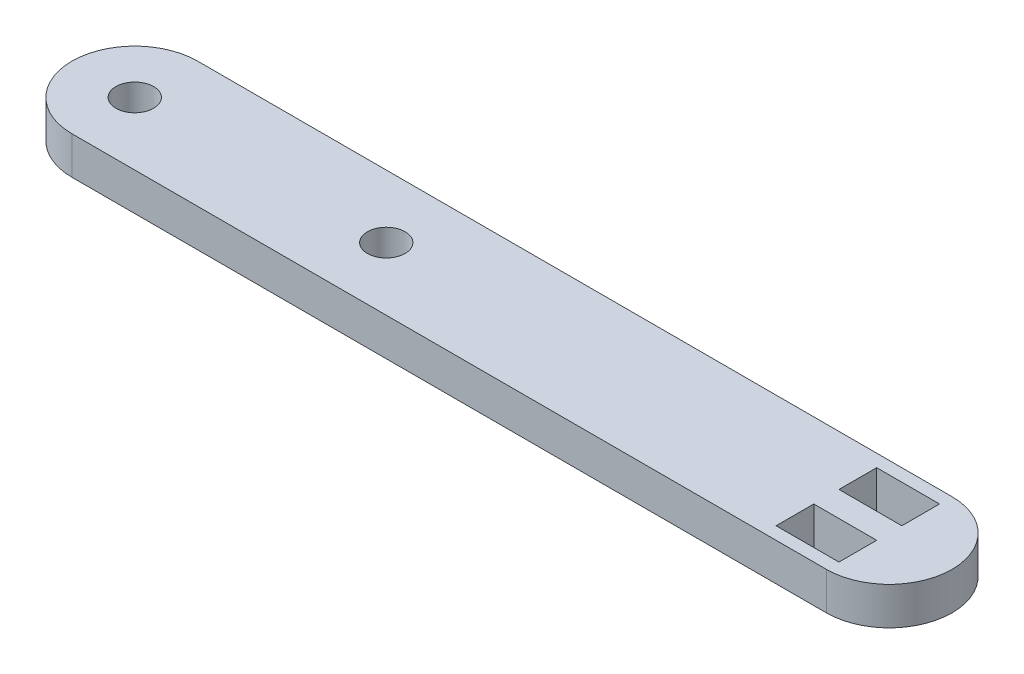
ISO-10303-21;
HEADER;
FILE_DESCRIPTION(('STEP AP214'),'2;1');
FILE_NAME('part.step','',(''),(''),'','','');
FILE_SCHEMA(('AUTOMOTIVE_DESIGN { 1 0 10303 214 1 1 1 1 }'));
ENDSEC;
DATA;
#1=APPLICATION_CONTEXT('core data for automotive mechanical design processes');
#2=APPLICATION_PROTOCOL_DEFINITION('international standard','automotive_design',2000,#1);
#3=PRODUCT_CONTEXT('',#1,'mechanical');
#4=PRODUCT('Part','Part','',(#3));
#5=PRODUCT_RELATED_PRODUCT_CATEGORY('part','',(#4));
#6=PRODUCT_DEFINITION_FORMATION('','',#4);
#7=PRODUCT_DEFINITION_CONTEXT('part definition',#1,'design');
#8=PRODUCT_DEFINITION('design','',#6,#7);
#9=PRODUCT_DEFINITION_SHAPE('','',#8);
#10=(LENGTH_UNIT() NAMED_UNIT(*) SI_UNIT(.MILLI.,.METRE.));
#11=(NAMED_UNIT(*) PLANE_ANGLE_UNIT() SI_UNIT($,.RADIAN.));
#12=(NAMED_UNIT(*) SI_UNIT($,.STERADIAN.) SOLID_ANGLE_UNIT());
#13=UNCERTAINTY_MEASURE_WITH_UNIT(LENGTH_MEASURE(1.E-05),#10,'distance_accuracy_value','');
#14=(GEOMETRIC_REPRESENTATION_CONTEXT(3) GLOBAL_UNCERTAINTY_ASSIGNED_CONTEXT((#13)) GLOBAL_UNIT_ASSIGNED_CONTEXT((#10,
#11,#12)) REPRESENTATION_CONTEXT('',''));
#15=CARTESIAN_POINT('',(0.,0.,0.));
#16=DIRECTION('',(0.,0.,1.));
#17=DIRECTION('',(1.,0.,0.));
#18=AXIS2_PLACEMENT_3D('',#15,#16,#17);
#19=CARTESIAN_POINT('',(0.,3.,-4.99999999999999));
#20=DIRECTION('',(0.,-1.,0.));
#21=DIRECTION('',(0.,0.,-1.));
#22=AXIS2_PLACEMENT_3D('',#19,#20,#21);
#23=PLANE('',#22);
#24=CARTESIAN_POINT('',(-40.,3.,-4.99999999999999));
#25=DIRECTION('',(0.,1.,0.));
#26=DIRECTION('',(0.,0.,1.));
#27=AXIS2_PLACEMENT_3D('',#24,#25,#26);
#28=CIRCLE('',#27,1.5);
#29=CARTESIAN_POINT('',(-40.,3.,-3.49999999999999));
#30=VERTEX_POINT('',#29);
#31=EDGE_CURVE('E159',#30,#30,#28,.T.);
#32=ORIENTED_EDGE('',*,*,#31,.F.);
#33=EDGE_LOOP('',(#32));
#34=FACE_BOUND('',#33,.T.);
#35=DIRECTION('',(0.,0.,-1.));
#36=VECTOR('',#35,1.);
#37=CARTESIAN_POINT('',(0.,3.,-6.));
#38=LINE('',#37,#36);
#39=CARTESIAN_POINT('',(0.,3.,-6.));
#40=VERTEX_POINT('',#39);
#41=CARTESIAN_POINT('',(0.,3.,-9.));
#42=VERTEX_POINT('',#41);
#43=EDGE_CURVE('E165',#40,#42,#38,.T.);
#44=ORIENTED_EDGE('',*,*,#43,.F.);
#45=DIRECTION('',(1.,0.,0.));
#46=VECTOR('',#45,1.);
#47=CARTESIAN_POINT('',(0.,3.,-6.));
#48=LINE('',#47,#46);
#49=CARTESIAN_POINT('',(-5.,3.,-6.));
#50=VERTEX_POINT('',#49);
#51=EDGE_CURVE('E173',#50,#40,#48,.T.);
#52=ORIENTED_EDGE('',*,*,#51,.F.);
#53=DIRECTION('',(0.,0.,1.));
#54=VECTOR('',#53,1.);
#55=CARTESIAN_POINT('',(-5.,3.,-6.));
#56=LINE('',#55,#54);
#57=CARTESIAN_POINT('',(-5.,3.,-9.));
#58=VERTEX_POINT('',#57);
#59=EDGE_CURVE('E170',#58,#50,#56,.T.);
#60=ORIENTED_EDGE('',*,*,#59,.F.);
#61=DIRECTION('',(-1.,0.,0.));
#62=VECTOR('',#61,1.);
#63=CARTESIAN_POINT('',(0.,3.,-9.));
#64=LINE('',#63,#62);
#65=EDGE_CURVE('E167',#42,#58,#64,.T.);
#66=ORIENTED_EDGE('',*,*,#65,.F.);
#67=EDGE_LOOP('',(#44,#52,#60,#66));
#68=FACE_BOUND('',#67,.T.);
#69=CARTESIAN_POINT('',(0.,3.,-4.99999999999999));
#70=DIRECTION('',(0.,1.,0.));
#71=DIRECTION('',(0.,0.,-1.));
#72=AXIS2_PLACEMENT_3D('',#69,#70,#71);
#73=CIRCLE('',#72,5.);
#74=CARTESIAN_POINT('',(0.,3.,0.));
#75=VERTEX_POINT('',#74);
#76=CARTESIAN_POINT('',(0.,3.,-10.));
#77=VERTEX_POINT('',#76);
#78=EDGE_CURVE('E202',#75,#77,#73,.T.);
#79=ORIENTED_EDGE('',*,*,#78,.T.);
#80=DIRECTION('',(-1.,0.,0.));
#81=VECTOR('',#80,1.);
#82=CARTESIAN_POINT('',(0.,3.,-10.));
#83=LINE('',#82,#81);
#84=CARTESIAN_POINT('',(-60.,3.,-9.99999999999999));
#85=VERTEX_POINT('',#84);
#86=EDGE_CURVE('E205',#77,#85,#83,.T.);
#87=ORIENTED_EDGE('',*,*,#86,.T.);
#88=CARTESIAN_POINT('',(-60.,3.,-4.99999999999999));
#89=DIRECTION('',(0.,1.,0.));
#90=DIRECTION('',(0.,0.,1.));
#91=AXIS2_PLACEMENT_3D('',#88,#89,#90);
#92=CIRCLE('',#91,5.);
#93=CARTESIAN_POINT('',(-60.,3.,0.));
#94=VERTEX_POINT('',#93);
#95=EDGE_CURVE('E208',#85,#94,#92,.T.);
#96=ORIENTED_EDGE('',*,*,#95,.T.);
#97=DIRECTION('',(1.,0.,0.));
#98=VECTOR('',#97,1.);
#99=CARTESIAN_POINT('',(0.,3.,0.));
#100=LINE('',#99,#98);
#101=EDGE_CURVE('E210',#94,#75,#100,.T.);
#102=ORIENTED_EDGE('',*,*,#101,.T.);
#103=EDGE_LOOP('',(#79,#87,#96,#102));
#104=FACE_BOUND('',#103,.T.);
#105=CARTESIAN_POINT('',(-60.,3.,-4.99999999999999));
#106=DIRECTION('',(0.,1.,0.));
#107=DIRECTION('',(0.,0.,1.));
#108=AXIS2_PLACEMENT_3D('',#105,#106,#107);
#109=CIRCLE('',#108,1.5);
#110=CARTESIAN_POINT('',(-60.,3.,-3.49999999999999));
#111=VERTEX_POINT('',#110);
#112=EDGE_CURVE('E196',#111,#111,#109,.T.);
#113=ORIENTED_EDGE('',*,*,#112,.F.);
#114=EDGE_LOOP('',(#113));
#115=FACE_BOUND('',#114,.T.);
#116=DIRECTION('',(0.,0.,-1.));
#117=VECTOR('',#116,1.);
#118=CARTESIAN_POINT('',(0.,3.,-3.99999999999999));
#119=LINE('',#118,#117);
#120=CARTESIAN_POINT('',(0.,3.,-0.99999999999999));
#121=VERTEX_POINT('',#120);
#122=CARTESIAN_POINT('',(0.,3.,-3.99999999999999));
#123=VERTEX_POINT('',#122);
#124=EDGE_CURVE('E123',#121,#123,#119,.T.);
#125=ORIENTED_EDGE('',*,*,#124,.F.);
#126=DIRECTION('',(1.,0.,0.));
#127=VECTOR('',#126,1.);
#128=CARTESIAN_POINT('',(0.,3.,-0.99999999999999));
#129=LINE('',#128,#127);
#130=CARTESIAN_POINT('',(-5.,3.,-0.99999999999999));
#131=VERTEX_POINT('',#130);
#132=EDGE_CURVE('E145',#131,#121,#129,.T.);
#133=ORIENTED_EDGE('',*,*,#132,.F.);
#134=DIRECTION('',(0.,0.,1.));
#135=VECTOR('',#134,1.);
#136=CARTESIAN_POINT('',(-5.,3.,-3.99999999999999));
#137=LINE('',#136,#135);
#138=CARTESIAN_POINT('',(-5.,3.,-3.99999999999999));
#139=VERTEX_POINT('',#138);
#140=EDGE_CURVE('E143',#139,#131,#137,.T.);
#141=ORIENTED_EDGE('',*,*,#140,.F.);
#142=DIRECTION('',(-1.,0.,0.));
#143=VECTOR('',#142,1.);
#144=CARTESIAN_POINT('',(0.,3.,-3.99999999999999));
#145=LINE('',#144,#143);
#146=EDGE_CURVE('E131',#123,#139,#145,.T.);
#147=ORIENTED_EDGE('',*,*,#146,.F.);
#148=EDGE_LOOP('',(#125,#133,#141,#147));
#149=FACE_BOUND('',#148,.T.);
#150=ADVANCED_FACE('F34',(#34,#68,#104,#115,#149),#23,.F.);
#151=CARTESIAN_POINT('',(0.,0.,-4.99999999999999));
#152=DIRECTION('',(0.,-1.,0.));
#153=DIRECTION('',(0.,0.,-1.));
#154=AXIS2_PLACEMENT_3D('',#151,#152,#153);
#155=PLANE('',#154);
#156=DIRECTION('',(1.,0.,0.));
#157=VECTOR('',#156,1.);
#158=CARTESIAN_POINT('',(0.,0.,-6.));
#159=LINE('',#158,#157);
#160=CARTESIAN_POINT('',(-5.,0.,-6.));
#161=VERTEX_POINT('',#160);
#162=CARTESIAN_POINT('',(0.,0.,-6.));
#163=VERTEX_POINT('',#162);
#164=EDGE_CURVE('E168',#161,#163,#159,.T.);
#165=ORIENTED_EDGE('',*,*,#164,.T.);
#166=DIRECTION('',(0.,0.,-1.));
#167=VECTOR('',#166,1.);
#168=CARTESIAN_POINT('',(0.,0.,-6.));
#169=LINE('',#168,#167);
#170=CARTESIAN_POINT('',(0.,0.,-9.));
#171=VERTEX_POINT('',#170);
#172=EDGE_CURVE('E162',#163,#171,#169,.T.);
#173=ORIENTED_EDGE('',*,*,#172,.T.);
#174=DIRECTION('',(-1.,0.,0.));
#175=VECTOR('',#174,1.);
#176=CARTESIAN_POINT('',(0.,0.,-9.));
#177=LINE('',#176,#175);
#178=CARTESIAN_POINT('',(-5.,0.,-9.));
#179=VERTEX_POINT('',#178);
#180=EDGE_CURVE('E178',#171,#179,#177,.T.);
#181=ORIENTED_EDGE('',*,*,#180,.T.);
#182=DIRECTION('',(0.,0.,1.));
#183=VECTOR('',#182,1.);
#184=CARTESIAN_POINT('',(-5.,0.,-6.));
#185=LINE('',#184,#183);
#186=EDGE_CURVE('E181',#179,#161,#185,.T.);
#187=ORIENTED_EDGE('',*,*,#186,.T.);
#188=EDGE_LOOP('',(#165,#173,#181,#187));
#189=FACE_BOUND('',#188,.T.);
#190=CARTESIAN_POINT('',(-60.,0.,-4.99999999999999));
#191=DIRECTION('',(0.,1.,0.));
#192=DIRECTION('',(0.,0.,1.));
#193=AXIS2_PLACEMENT_3D('',#190,#191,#192);
#194=CIRCLE('',#193,1.5);
#195=CARTESIAN_POINT('',(-60.,0.,-3.49999999999999));
#196=VERTEX_POINT('',#195);
#197=EDGE_CURVE('E195',#196,#196,#194,.T.);
#198=ORIENTED_EDGE('',*,*,#197,.T.);
#199=EDGE_LOOP('',(#198));
#200=FACE_BOUND('',#199,.T.);
#201=CARTESIAN_POINT('',(0.,0.,-4.99999999999999));
#202=DIRECTION('',(0.,1.,0.));
#203=DIRECTION('',(0.,0.,-1.));
#204=AXIS2_PLACEMENT_3D('',#201,#202,#203);
#205=CIRCLE('',#204,5.);
#206=CARTESIAN_POINT('',(0.,0.,0.));
#207=VERTEX_POINT('',#206);
#208=CARTESIAN_POINT('',(0.,0.,-10.));
#209=VERTEX_POINT('',#208);
#210=EDGE_CURVE('E199',#207,#209,#205,.T.);
#211=ORIENTED_EDGE('',*,*,#210,.F.);
#212=DIRECTION('',(1.,0.,0.));
#213=VECTOR('',#212,1.);
#214=CARTESIAN_POINT('',(0.,0.,0.));
#215=LINE('',#214,#213);
#216=CARTESIAN_POINT('',(-60.,0.,0.));
#217=VERTEX_POINT('',#216);
#218=EDGE_CURVE('E206',#217,#207,#215,.T.);
#219=ORIENTED_EDGE('',*,*,#218,.F.);
#220=CARTESIAN_POINT('',(-60.,0.,-4.99999999999999));
#221=DIRECTION('',(0.,1.,0.));
#222=DIRECTION('',(0.,0.,1.));
#223=AXIS2_PLACEMENT_3D('',#220,#221,#222);
#224=CIRCLE('',#223,5.);
#225=CARTESIAN_POINT('',(-60.,0.,-9.99999999999999));
#226=VERTEX_POINT('',#225);
#227=EDGE_CURVE('E217',#226,#217,#224,.T.);
#228=ORIENTED_EDGE('',*,*,#227,.F.);
#229=DIRECTION('',(-1.,0.,0.));
#230=VECTOR('',#229,1.);
#231=CARTESIAN_POINT('',(0.,0.,-10.));
#232=LINE('',#231,#230);
#233=EDGE_CURVE('E215',#209,#226,#232,.T.);
#234=ORIENTED_EDGE('',*,*,#233,.F.);
#235=EDGE_LOOP('',(#211,#219,#228,#234));
#236=FACE_BOUND('',#235,.T.);
#237=CARTESIAN_POINT('',(-40.,0.,-4.99999999999999));
#238=DIRECTION('',(0.,1.,0.));
#239=DIRECTION('',(0.,0.,1.));
#240=AXIS2_PLACEMENT_3D('',#237,#238,#239);
#241=CIRCLE('',#240,1.5);
#242=CARTESIAN_POINT('',(-40.,0.,-3.49999999999999));
#243=VERTEX_POINT('',#242);
#244=EDGE_CURVE('E139',#243,#243,#241,.T.);
#245=ORIENTED_EDGE('',*,*,#244,.T.);
#246=EDGE_LOOP('',(#245));
#247=FACE_BOUND('',#246,.T.);
#248=DIRECTION('',(1.,0.,0.));
#249=VECTOR('',#248,1.);
#250=CARTESIAN_POINT('',(0.,0.,-0.99999999999999));
#251=LINE('',#250,#249);
#252=CARTESIAN_POINT('',(-5.,0.,-0.99999999999999));
#253=VERTEX_POINT('',#252);
#254=CARTESIAN_POINT('',(0.,0.,-0.99999999999999));
#255=VERTEX_POINT('',#254);
#256=EDGE_CURVE('E132',#253,#255,#251,.T.);
#257=ORIENTED_EDGE('',*,*,#256,.T.);
#258=DIRECTION('',(0.,0.,-1.));
#259=VECTOR('',#258,1.);
#260=CARTESIAN_POINT('',(0.,0.,-3.99999999999999));
#261=LINE('',#260,#259);
#262=CARTESIAN_POINT('',(0.,0.,-3.99999999999999));
#263=VERTEX_POINT('',#262);
#264=EDGE_CURVE('E57',#255,#263,#261,.T.);
#265=ORIENTED_EDGE('',*,*,#264,.T.);
#266=DIRECTION('',(-1.,0.,0.));
#267=VECTOR('',#266,1.);
#268=CARTESIAN_POINT('',(0.,0.,-3.99999999999999));
#269=LINE('',#268,#267);
#270=CARTESIAN_POINT('',(-5.,0.,-3.99999999999999));
#271=VERTEX_POINT('',#270);
#272=EDGE_CURVE('E138',#263,#271,#269,.T.);
#273=ORIENTED_EDGE('',*,*,#272,.T.);
#274=DIRECTION('',(0.,0.,1.));
#275=VECTOR('',#274,1.);
#276=CARTESIAN_POINT('',(-5.,0.,-3.99999999999999));
#277=LINE('',#276,#275);
#278=EDGE_CURVE('E151',#271,#253,#277,.T.);
#279=ORIENTED_EDGE('',*,*,#278,.T.);
#280=EDGE_LOOP('',(#257,#265,#273,#279));
#281=FACE_BOUND('',#280,.T.);
#282=ADVANCED_FACE('F235',(#189,#200,#236,#247,#281),#155,.T.);
#283=CARTESIAN_POINT('',(0.,3.,-4.99999999999999));
#284=DIRECTION('',(0.,-1.,0.));
#285=DIRECTION('',(0.,0.,-1.));
#286=AXIS2_PLACEMENT_3D('',#283,#284,#285);
#287=CYLINDRICAL_SURFACE('',#286,5.);
#288=ORIENTED_EDGE('',*,*,#210,.T.);
#289=DIRECTION('',(0.,-1.,0.));
#290=VECTOR('',#289,1.);
#291=CARTESIAN_POINT('',(0.,3.,-10.));
#292=LINE('',#291,#290);
#293=EDGE_CURVE('E11',#77,#209,#292,.T.);
#294=ORIENTED_EDGE('',*,*,#293,.F.);
#295=ORIENTED_EDGE('',*,*,#78,.F.);
#296=DIRECTION('',(0.,-1.,0.));
#297=VECTOR('',#296,1.);
#298=CARTESIAN_POINT('',(0.,3.,0.));
#299=LINE('',#298,#297);
#300=EDGE_CURVE('E212',#75,#207,#299,.T.);
#301=ORIENTED_EDGE('',*,*,#300,.T.);
#302=EDGE_LOOP('',(#288,#294,#295,#301));
#303=FACE_BOUND('',#302,.T.);
#304=ADVANCED_FACE('F36',(#303),#287,.T.);
#305=CARTESIAN_POINT('',(0.,3.,-10.));
#306=DIRECTION('',(0.,0.,1.));
#307=DIRECTION('',(1.,0.,0.));
#308=AXIS2_PLACEMENT_3D('',#305,#306,#307);
#309=PLANE('',#308);
#310=ORIENTED_EDGE('',*,*,#233,.T.);
#311=DIRECTION('',(0.,-1.,0.));
#312=VECTOR('',#311,1.);
#313=CARTESIAN_POINT('',(-60.,3.,-9.99999999999999));
#314=LINE('',#313,#312);
#315=EDGE_CURVE('E42',#85,#226,#314,.T.);
#316=ORIENTED_EDGE('',*,*,#315,.F.);
#317=ORIENTED_EDGE('',*,*,#86,.F.);
#318=ORIENTED_EDGE('',*,*,#293,.T.);
#319=EDGE_LOOP('',(#310,#316,#317,#318));
#320=FACE_BOUND('',#319,.T.);
#321=ADVANCED_FACE('F246',(#320),#309,.F.);
#322=CARTESIAN_POINT('',(-60.,3.,-4.99999999999999));
#323=DIRECTION('',(0.,-1.,0.));
#324=DIRECTION('',(0.,0.,-1.));
#325=AXIS2_PLACEMENT_3D('',#322,#323,#324);
#326=CYLINDRICAL_SURFACE('',#325,5.);
#327=ORIENTED_EDGE('',*,*,#227,.T.);
#328=DIRECTION('',(0.,-1.,0.));
#329=VECTOR('',#328,1.);
#330=CARTESIAN_POINT('',(-60.,3.,0.));
#331=LINE('',#330,#329);
#332=EDGE_CURVE('E222',#94,#217,#331,.T.);
#333=ORIENTED_EDGE('',*,*,#332,.F.);
#334=ORIENTED_EDGE('',*,*,#95,.F.);
#335=ORIENTED_EDGE('',*,*,#315,.T.);
#336=EDGE_LOOP('',(#327,#333,#334,#335));
#337=FACE_BOUND('',#336,.T.);
#338=ADVANCED_FACE('F229',(#337),#326,.T.);
#339=CARTESIAN_POINT('',(0.,3.,0.));
#340=DIRECTION('',(0.,0.,-1.));
#341=DIRECTION('',(-1.,0.,0.));
#342=AXIS2_PLACEMENT_3D('',#339,#340,#341);
#343=PLANE('',#342);
#344=ORIENTED_EDGE('',*,*,#218,.T.);
#345=ORIENTED_EDGE('',*,*,#300,.F.);
#346=ORIENTED_EDGE('',*,*,#101,.F.);
#347=ORIENTED_EDGE('',*,*,#332,.T.);
#348=EDGE_LOOP('',(#344,#345,#346,#347));
#349=FACE_BOUND('',#348,.T.);
#350=ADVANCED_FACE('F239',(#349),#343,.F.);
#351=CARTESIAN_POINT('',(-60.,3.,-4.99999999999999));
#352=DIRECTION('',(0.,-1.,0.));
#353=DIRECTION('',(0.,0.,-1.));
#354=AXIS2_PLACEMENT_3D('',#351,#352,#353);
#355=CYLINDRICAL_SURFACE('',#354,1.5);
#356=ORIENTED_EDGE('',*,*,#112,.T.);
#357=EDGE_LOOP('',(#356));
#358=FACE_BOUND('',#357,.T.);
#359=ORIENTED_EDGE('',*,*,#197,.F.);
#360=EDGE_LOOP('',(#359));
#361=FACE_BOUND('',#360,.T.);
#362=ADVANCED_FACE('F264',(#358,#361),#355,.F.);
#363=CARTESIAN_POINT('',(0.,3.,-6.));
#364=DIRECTION('',(-1.,0.,0.));
#365=DIRECTION('',(0.,0.,1.));
#366=AXIS2_PLACEMENT_3D('',#363,#364,#365);
#367=PLANE('',#366);
#368=ORIENTED_EDGE('',*,*,#172,.F.);
#369=DIRECTION('',(0.,-1.,0.));
#370=VECTOR('',#369,1.);
#371=CARTESIAN_POINT('',(0.,3.,-6.));
#372=LINE('',#371,#370);
#373=EDGE_CURVE('E175',#40,#163,#372,.T.);
#374=ORIENTED_EDGE('',*,*,#373,.F.);
#375=ORIENTED_EDGE('',*,*,#43,.T.);
#376=DIRECTION('',(0.,-1.,0.));
#377=VECTOR('',#376,1.);
#378=CARTESIAN_POINT('',(0.,3.,-9.));
#379=LINE('',#378,#377);
#380=EDGE_CURVE('E192',#42,#171,#379,.T.);
#381=ORIENTED_EDGE('',*,*,#380,.T.);
#382=EDGE_LOOP('',(#368,#374,#375,#381));
#383=FACE_BOUND('',#382,.T.);
#384=ADVANCED_FACE('F271',(#383),#367,.T.);
#385=CARTESIAN_POINT('',(0.,3.,-9.));
#386=DIRECTION('',(0.,0.,1.));
#387=DIRECTION('',(1.,0.,0.));
#388=AXIS2_PLACEMENT_3D('',#385,#386,#387);
#389=PLANE('',#388);
#390=ORIENTED_EDGE('',*,*,#180,.F.);
#391=ORIENTED_EDGE('',*,*,#380,.F.);
#392=ORIENTED_EDGE('',*,*,#65,.T.);
#393=DIRECTION('',(0.,-1.,0.));
#394=VECTOR('',#393,1.);
#395=CARTESIAN_POINT('',(-5.,3.,-9.));
#396=LINE('',#395,#394);
#397=EDGE_CURVE('E190',#58,#179,#396,.T.);
#398=ORIENTED_EDGE('',*,*,#397,.T.);
#399=EDGE_LOOP('',(#390,#391,#392,#398));
#400=FACE_BOUND('',#399,.T.);
#401=ADVANCED_FACE('F276',(#400),#389,.T.);
#402=CARTESIAN_POINT('',(-5.,3.,-6.));
#403=DIRECTION('',(1.,0.,0.));
#404=DIRECTION('',(0.,0.,-1.));
#405=AXIS2_PLACEMENT_3D('',#402,#403,#404);
#406=PLANE('',#405);
#407=ORIENTED_EDGE('',*,*,#186,.F.);
#408=ORIENTED_EDGE('',*,*,#397,.F.);
#409=ORIENTED_EDGE('',*,*,#59,.T.);
#410=DIRECTION('',(0.,-1.,0.));
#411=VECTOR('',#410,1.);
#412=CARTESIAN_POINT('',(-5.,3.,-6.));
#413=LINE('',#412,#411);
#414=EDGE_CURVE('E188',#50,#161,#413,.T.);
#415=ORIENTED_EDGE('',*,*,#414,.T.);
#416=EDGE_LOOP('',(#407,#408,#409,#415));
#417=FACE_BOUND('',#416,.T.);
#418=ADVANCED_FACE('F285',(#417),#406,.T.);
#419=CARTESIAN_POINT('',(0.,3.,-6.));
#420=DIRECTION('',(0.,0.,-1.));
#421=DIRECTION('',(-1.,0.,0.));
#422=AXIS2_PLACEMENT_3D('',#419,#420,#421);
#423=PLANE('',#422);
#424=ORIENTED_EDGE('',*,*,#164,.F.);
#425=ORIENTED_EDGE('',*,*,#414,.F.);
#426=ORIENTED_EDGE('',*,*,#51,.T.);
#427=ORIENTED_EDGE('',*,*,#373,.T.);
#428=EDGE_LOOP('',(#424,#425,#426,#427));
#429=FACE_BOUND('',#428,.T.);
#430=ADVANCED_FACE('F291',(#429),#423,.T.);
#431=CARTESIAN_POINT('',(-40.,3.,-4.99999999999999));
#432=DIRECTION('',(0.,-1.,0.));
#433=DIRECTION('',(0.,0.,-1.));
#434=AXIS2_PLACEMENT_3D('',#431,#432,#433);
#435=CYLINDRICAL_SURFACE('',#434,1.5);
#436=ORIENTED_EDGE('',*,*,#31,.T.);
#437=EDGE_LOOP('',(#436));
#438=FACE_BOUND('',#437,.T.);
#439=ORIENTED_EDGE('',*,*,#244,.F.);
#440=EDGE_LOOP('',(#439));
#441=FACE_BOUND('',#440,.T.);
#442=ADVANCED_FACE('F295',(#438,#441),#435,.F.);
#443=CARTESIAN_POINT('',(0.,3.,-3.99999999999999));
#444=DIRECTION('',(-1.,0.,0.));
#445=DIRECTION('',(0.,0.,1.));
#446=AXIS2_PLACEMENT_3D('',#443,#444,#445);
#447=PLANE('',#446);
#448=ORIENTED_EDGE('',*,*,#264,.F.);
#449=DIRECTION('',(0.,-1.,0.));
#450=VECTOR('',#449,1.);
#451=CARTESIAN_POINT('',(0.,3.,-0.99999999999999));
#452=LINE('',#451,#450);
#453=EDGE_CURVE('E127',#121,#255,#452,.T.);
#454=ORIENTED_EDGE('',*,*,#453,.F.);
#455=ORIENTED_EDGE('',*,*,#124,.T.);
#456=DIRECTION('',(0.,-1.,0.));
#457=VECTOR('',#456,1.);
#458=CARTESIAN_POINT('',(0.,3.,-3.99999999999999));
#459=LINE('',#458,#457);
#460=EDGE_CURVE('E126',#123,#263,#459,.T.);
#461=ORIENTED_EDGE('',*,*,#460,.T.);
#462=EDGE_LOOP('',(#448,#454,#455,#461));
#463=FACE_BOUND('',#462,.T.);
#464=ADVANCED_FACE('F125',(#463),#447,.T.);
#465=CARTESIAN_POINT('',(0.,3.,-3.99999999999999));
#466=DIRECTION('',(0.,0.,1.));
#467=DIRECTION('',(1.,0.,0.));
#468=AXIS2_PLACEMENT_3D('',#465,#466,#467);
#469=PLANE('',#468);
#470=ORIENTED_EDGE('',*,*,#272,.F.);
#471=ORIENTED_EDGE('',*,*,#460,.F.);
#472=ORIENTED_EDGE('',*,*,#146,.T.);
#473=DIRECTION('',(0.,-1.,0.));
#474=VECTOR('',#473,1.);
#475=CARTESIAN_POINT('',(-5.,3.,-3.99999999999999));
#476=LINE('',#475,#474);
#477=EDGE_CURVE('E140',#139,#271,#476,.T.);
#478=ORIENTED_EDGE('',*,*,#477,.T.);
#479=EDGE_LOOP('',(#470,#471,#472,#478));
#480=FACE_BOUND('',#479,.T.);
#481=ADVANCED_FACE('F135',(#480),#469,.T.);
#482=CARTESIAN_POINT('',(-5.,3.,-3.99999999999999));
#483=DIRECTION('',(1.,0.,0.));
#484=DIRECTION('',(0.,0.,-1.));
#485=AXIS2_PLACEMENT_3D('',#482,#483,#484);
#486=PLANE('',#485);
#487=ORIENTED_EDGE('',*,*,#278,.F.);
#488=ORIENTED_EDGE('',*,*,#477,.F.);
#489=ORIENTED_EDGE('',*,*,#140,.T.);
#490=DIRECTION('',(0.,-1.,0.));
#491=VECTOR('',#490,1.);
#492=CARTESIAN_POINT('',(-5.,3.,-0.99999999999999));
#493=LINE('',#492,#491);
#494=EDGE_CURVE('E49',#131,#253,#493,.T.);
#495=ORIENTED_EDGE('',*,*,#494,.T.);
#496=EDGE_LOOP('',(#487,#488,#489,#495));
#497=FACE_BOUND('',#496,.T.);
#498=ADVANCED_FACE('F304',(#497),#486,.T.);
#499=CARTESIAN_POINT('',(0.,3.,-0.99999999999999));
#500=DIRECTION('',(0.,0.,-1.));
#501=DIRECTION('',(-1.,0.,0.));
#502=AXIS2_PLACEMENT_3D('',#499,#500,#501);
#503=PLANE('',#502);
#504=ORIENTED_EDGE('',*,*,#256,.F.);
#505=ORIENTED_EDGE('',*,*,#494,.F.);
#506=ORIENTED_EDGE('',*,*,#132,.T.);
#507=ORIENTED_EDGE('',*,*,#453,.T.);
#508=EDGE_LOOP('',(#504,#505,#506,#507));
#509=FACE_BOUND('',#508,.T.);
#510=ADVANCED_FACE('F307',(#509),#503,.T.);
#511=CLOSED_SHELL('',(#150,#282,#304,#321,#338,#350,#362,#384,#401,#418,#430,#442,#464,#481,
#498,#510));
#512=MANIFOLD_SOLID_BREP('B2',#511);
#513=ADVANCED_BREP_SHAPE_REPRESENTATION('',(#18,#512),#14);
#514=SHAPE_DEFINITION_REPRESENTATION(#9,#513);
ENDSEC;
END-ISO-10303-21;
